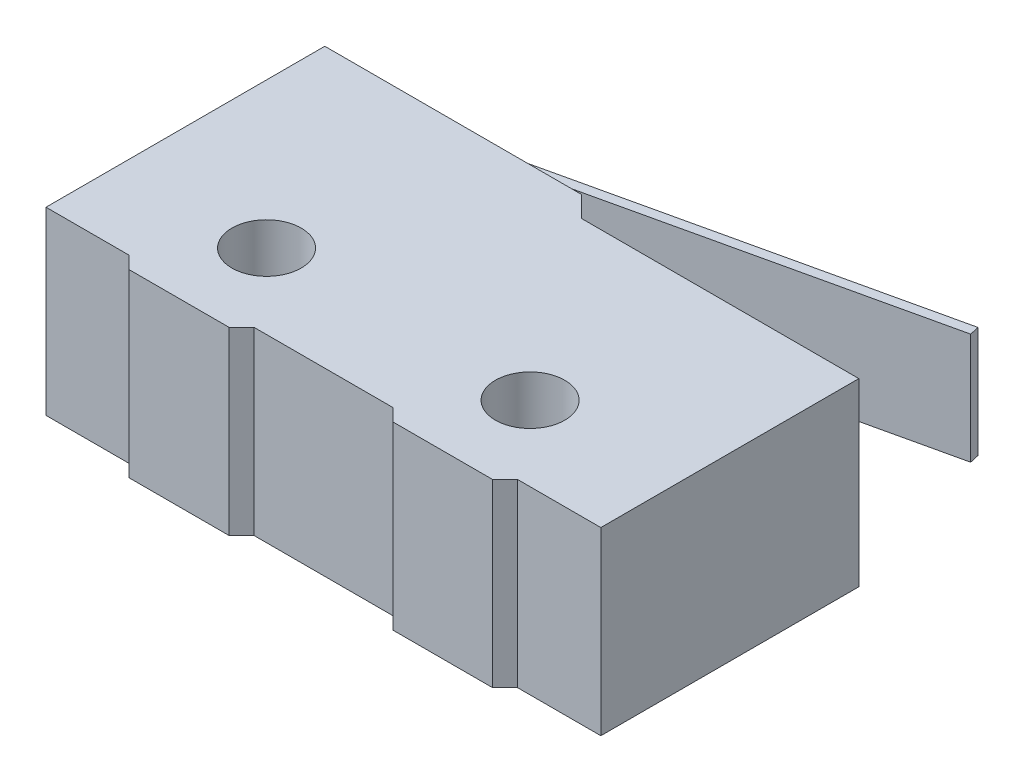
ISO-10303-21;
HEADER;
FILE_DESCRIPTION(('STEP AP214'),'2;1');
FILE_NAME('part.step','',(''),(''),'','','');
FILE_SCHEMA(('AUTOMOTIVE_DESIGN { 1 0 10303 214 1 1 1 1 }'));
ENDSEC;
DATA;
#1=APPLICATION_CONTEXT('core data for automotive mechanical design processes');
#2=APPLICATION_PROTOCOL_DEFINITION('international standard','automotive_design',2000,#1);
#3=PRODUCT_CONTEXT('',#1,'mechanical');
#4=PRODUCT('Part','Part','',(#3));
#5=PRODUCT_RELATED_PRODUCT_CATEGORY('part','',(#4));
#6=PRODUCT_DEFINITION_FORMATION('','',#4);
#7=PRODUCT_DEFINITION_CONTEXT('part definition',#1,'design');
#8=PRODUCT_DEFINITION('design','',#6,#7);
#9=PRODUCT_DEFINITION_SHAPE('','',#8);
#10=(LENGTH_UNIT() NAMED_UNIT(*) SI_UNIT(.MILLI.,.METRE.));
#11=(NAMED_UNIT(*) PLANE_ANGLE_UNIT() SI_UNIT($,.RADIAN.));
#12=(NAMED_UNIT(*) SI_UNIT($,.STERADIAN.) SOLID_ANGLE_UNIT());
#13=UNCERTAINTY_MEASURE_WITH_UNIT(LENGTH_MEASURE(1.E-05),#10,'distance_accuracy_value','');
#14=(GEOMETRIC_REPRESENTATION_CONTEXT(3) GLOBAL_UNCERTAINTY_ASSIGNED_CONTEXT((#13)) GLOBAL_UNIT_ASSIGNED_CONTEXT((#10,
#11,#12)) REPRESENTATION_CONTEXT('',''));
#15=CARTESIAN_POINT('',(0.,0.,0.));
#16=DIRECTION('',(0.,0.,1.));
#17=DIRECTION('',(1.,0.,0.));
#18=AXIS2_PLACEMENT_3D('',#15,#16,#17);
#19=CARTESIAN_POINT('',(-10.,6.5,5.25));
#20=DIRECTION('',(0.,0.,-1.));
#21=DIRECTION('',(-1.,0.,0.));
#22=AXIS2_PLACEMENT_3D('',#19,#20,#21);
#23=PLANE('',#22);
#24=DIRECTION('',(1.,0.,0.));
#25=VECTOR('',#24,1.);
#26=CARTESIAN_POINT('',(-10.,0.,5.25));
#27=LINE('',#26,#25);
#28=CARTESIAN_POINT('',(-6.55,0.,5.25));
#29=VERTEX_POINT('',#28);
#30=CARTESIAN_POINT('',(-2.95,0.,5.25));
#31=VERTEX_POINT('',#30);
#32=EDGE_CURVE('E292',#29,#31,#27,.T.);
#33=ORIENTED_EDGE('',*,*,#32,.T.);
#34=DIRECTION('',(0.,1.,0.));
#35=VECTOR('',#34,1.);
#36=CARTESIAN_POINT('',(-2.95,6.5,5.25));
#37=LINE('',#36,#35);
#38=CARTESIAN_POINT('',(-2.95,6.5,5.25));
#39=VERTEX_POINT('',#38);
#40=EDGE_CURVE('E329',#31,#39,#37,.T.);
#41=ORIENTED_EDGE('',*,*,#40,.T.);
#42=DIRECTION('',(1.,0.,0.));
#43=VECTOR('',#42,1.);
#44=CARTESIAN_POINT('',(-10.,6.5,5.25));
#45=LINE('',#44,#43);
#46=CARTESIAN_POINT('',(-6.55,6.5,5.25));
#47=VERTEX_POINT('',#46);
#48=EDGE_CURVE('E280',#47,#39,#45,.T.);
#49=ORIENTED_EDGE('',*,*,#48,.F.);
#50=DIRECTION('',(0.,-1.,0.));
#51=VECTOR('',#50,1.);
#52=CARTESIAN_POINT('',(-6.55,6.5,5.25));
#53=LINE('',#52,#51);
#54=EDGE_CURVE('E326',#47,#29,#53,.T.);
#55=ORIENTED_EDGE('',*,*,#54,.T.);
#56=EDGE_LOOP('',(#33,#41,#49,#55));
#57=FACE_BOUND('',#56,.T.);
#58=ADVANCED_FACE('F33',(#57),#23,.F.);
#59=CARTESIAN_POINT('',(-10.,6.5,-5.25));
#60=DIRECTION('',(1.,0.,0.));
#61=DIRECTION('',(0.,0.,-1.));
#62=AXIS2_PLACEMENT_3D('',#59,#60,#61);
#63=PLANE('',#62);
#64=DIRECTION('',(0.,0.,1.));
#65=VECTOR('',#64,1.);
#66=CARTESIAN_POINT('',(-10.,0.,-5.25));
#67=LINE('',#66,#65);
#68=CARTESIAN_POINT('',(-10.,0.,-5.25));
#69=VERTEX_POINT('',#68);
#70=CARTESIAN_POINT('',(-10.,0.,4.8));
#71=VERTEX_POINT('',#70);
#72=EDGE_CURVE('E272',#69,#71,#67,.T.);
#73=ORIENTED_EDGE('',*,*,#72,.T.);
#74=DIRECTION('',(0.,1.,0.));
#75=VECTOR('',#74,1.);
#76=CARTESIAN_POINT('',(-10.,6.5,4.8));
#77=LINE('',#76,#75);
#78=CARTESIAN_POINT('',(-10.,6.5,4.8));
#79=VERTEX_POINT('',#78);
#80=EDGE_CURVE('E259',#71,#79,#77,.T.);
#81=ORIENTED_EDGE('',*,*,#80,.T.);
#82=DIRECTION('',(0.,0.,1.));
#83=VECTOR('',#82,1.);
#84=CARTESIAN_POINT('',(-10.,6.5,-5.25));
#85=LINE('',#84,#83);
#86=CARTESIAN_POINT('',(-10.,6.5,-5.25));
#87=VERTEX_POINT('',#86);
#88=EDGE_CURVE('E275',#87,#79,#85,.T.);
#89=ORIENTED_EDGE('',*,*,#88,.F.);
#90=DIRECTION('',(0.,-1.,0.));
#91=VECTOR('',#90,1.);
#92=CARTESIAN_POINT('',(-10.,6.5,-5.25));
#93=LINE('',#92,#91);
#94=EDGE_CURVE('E288',#87,#69,#93,.T.);
#95=ORIENTED_EDGE('',*,*,#94,.T.);
#96=EDGE_LOOP('',(#73,#81,#89,#95));
#97=FACE_BOUND('',#96,.T.);
#98=ADVANCED_FACE('F356',(#97),#63,.F.);
#99=CARTESIAN_POINT('',(2.94999999999886,0.,5.25));
#100=VERTEX_POINT('',#99);
#101=CARTESIAN_POINT('',(6.55,0.,5.25));
#102=VERTEX_POINT('',#101);
#103=EDGE_CURVE('E291',#100,#102,#27,.T.);
#104=ORIENTED_EDGE('',*,*,#103,.T.);
#105=DIRECTION('',(0.,1.,0.));
#106=VECTOR('',#105,1.);
#107=CARTESIAN_POINT('',(6.55,6.5,5.25));
#108=LINE('',#107,#106);
#109=CARTESIAN_POINT('',(6.55,6.5,5.25));
#110=VERTEX_POINT('',#109);
#111=EDGE_CURVE('E307',#102,#110,#108,.T.);
#112=ORIENTED_EDGE('',*,*,#111,.T.);
#113=CARTESIAN_POINT('',(2.94999999999886,6.5,5.25));
#114=VERTEX_POINT('',#113);
#115=EDGE_CURVE('E278',#114,#110,#45,.T.);
#116=ORIENTED_EDGE('',*,*,#115,.F.);
#117=DIRECTION('',(0.,-1.,0.));
#118=VECTOR('',#117,1.);
#119=CARTESIAN_POINT('',(2.94999999999886,6.5,5.25));
#120=LINE('',#119,#118);
#121=EDGE_CURVE('E304',#114,#100,#120,.T.);
#122=ORIENTED_EDGE('',*,*,#121,.T.);
#123=EDGE_LOOP('',(#104,#112,#116,#122));
#124=FACE_BOUND('',#123,.T.);
#125=ADVANCED_FACE('F385',(#124),#23,.F.);
#126=CARTESIAN_POINT('',(10.,6.5,-5.25));
#127=DIRECTION('',(-1.,0.,0.));
#128=DIRECTION('',(0.,0.,1.));
#129=AXIS2_PLACEMENT_3D('',#126,#127,#128);
#130=PLANE('',#129);
#131=DIRECTION('',(0.,0.,-1.));
#132=VECTOR('',#131,1.);
#133=CARTESIAN_POINT('',(10.,0.,-5.25));
#134=LINE('',#133,#132);
#135=CARTESIAN_POINT('',(10.,0.,4.8));
#136=VERTEX_POINT('',#135);
#137=CARTESIAN_POINT('',(10.,0.,-4.5));
#138=VERTEX_POINT('',#137);
#139=EDGE_CURVE('E295',#136,#138,#134,.T.);
#140=ORIENTED_EDGE('',*,*,#139,.T.);
#141=DIRECTION('',(0.,1.,0.));
#142=VECTOR('',#141,1.);
#143=CARTESIAN_POINT('',(10.,6.5,-4.5));
#144=LINE('',#143,#142);
#145=CARTESIAN_POINT('',(10.,6.5,-4.5));
#146=VERTEX_POINT('',#145);
#147=EDGE_CURVE('E229',#138,#146,#144,.T.);
#148=ORIENTED_EDGE('',*,*,#147,.T.);
#149=DIRECTION('',(0.,0.,-1.));
#150=VECTOR('',#149,1.);
#151=CARTESIAN_POINT('',(10.,6.5,-5.25));
#152=LINE('',#151,#150);
#153=CARTESIAN_POINT('',(10.,6.5,4.8));
#154=VERTEX_POINT('',#153);
#155=EDGE_CURVE('E283',#154,#146,#152,.T.);
#156=ORIENTED_EDGE('',*,*,#155,.F.);
#157=DIRECTION('',(0.,-1.,0.));
#158=VECTOR('',#157,1.);
#159=CARTESIAN_POINT('',(10.,6.5,4.8));
#160=LINE('',#159,#158);
#161=EDGE_CURVE('E238',#154,#136,#160,.T.);
#162=ORIENTED_EDGE('',*,*,#161,.T.);
#163=EDGE_LOOP('',(#140,#148,#156,#162));
#164=FACE_BOUND('',#163,.T.);
#165=ADVANCED_FACE('F396',(#164),#130,.F.);
#166=CARTESIAN_POINT('',(-10.,6.5,-5.25));
#167=DIRECTION('',(0.,0.,1.));
#168=DIRECTION('',(1.,0.,0.));
#169=AXIS2_PLACEMENT_3D('',#166,#167,#168);
#170=PLANE('',#169);
#171=DIRECTION('',(0.,1.,0.));
#172=VECTOR('',#171,1.);
#173=CARTESIAN_POINT('',(-7.,1.25,-5.24999999999477));
#174=LINE('',#173,#172);
#175=CARTESIAN_POINT('',(-7.,1.25,-5.25));
#176=VERTEX_POINT('',#175);
#177=CARTESIAN_POINT('',(-7.,5.25,-5.25));
#178=VERTEX_POINT('',#177);
#179=EDGE_CURVE('E53',#176,#178,#174,.T.);
#180=ORIENTED_EDGE('',*,*,#179,.F.);
#181=DIRECTION('',(1.,0.,-1.49409254809488E-11));
#182=VECTOR('',#181,1.);
#183=CARTESIAN_POINT('',(-6.65,1.25,-5.25));
#184=LINE('',#183,#182);
#185=CARTESIAN_POINT('',(-6.65,1.25,-5.25));
#186=VERTEX_POINT('',#185);
#187=EDGE_CURVE('E48',#176,#186,#184,.T.);
#188=ORIENTED_EDGE('',*,*,#187,.T.);
#189=DIRECTION('',(0.,1.,0.));
#190=VECTOR('',#189,1.);
#191=CARTESIAN_POINT('',(-6.65,1.25,-5.25));
#192=LINE('',#191,#190);
#193=CARTESIAN_POINT('',(-6.65,5.25,-5.25));
#194=VERTEX_POINT('',#193);
#195=EDGE_CURVE('E190',#186,#194,#192,.T.);
#196=ORIENTED_EDGE('',*,*,#195,.T.);
#197=DIRECTION('',(1.,0.,-1.49409254809488E-11));
#198=VECTOR('',#197,1.);
#199=CARTESIAN_POINT('',(-6.65,5.25,-5.25));
#200=LINE('',#199,#198);
#201=EDGE_CURVE('E191',#178,#194,#200,.T.);
#202=ORIENTED_EDGE('',*,*,#201,.F.);
#203=EDGE_LOOP('',(#180,#188,#196,#202));
#204=FACE_BOUND('',#203,.T.);
#205=DIRECTION('',(-1.,0.,0.));
#206=VECTOR('',#205,1.);
#207=CARTESIAN_POINT('',(-10.,6.5,-5.25));
#208=LINE('',#207,#206);
#209=CARTESIAN_POINT('',(-0.750000000000002,6.5,-5.25));
#210=VERTEX_POINT('',#209);
#211=EDGE_CURVE('E286',#210,#87,#208,.T.);
#212=ORIENTED_EDGE('',*,*,#211,.F.);
#213=DIRECTION('',(0.,-1.,0.));
#214=VECTOR('',#213,1.);
#215=CARTESIAN_POINT('',(-0.750000000000001,6.5,-5.25));
#216=LINE('',#215,#214);
#217=CARTESIAN_POINT('',(-0.750000000000001,0.,-5.25));
#218=VERTEX_POINT('',#217);
#219=EDGE_CURVE('E332',#210,#218,#216,.T.);
#220=ORIENTED_EDGE('',*,*,#219,.T.);
#221=DIRECTION('',(-1.,0.,0.));
#222=VECTOR('',#221,1.);
#223=CARTESIAN_POINT('',(-10.,0.,-5.25));
#224=LINE('',#223,#222);
#225=EDGE_CURVE('E279',#218,#69,#224,.T.);
#226=ORIENTED_EDGE('',*,*,#225,.T.);
#227=ORIENTED_EDGE('',*,*,#94,.F.);
#228=EDGE_LOOP('',(#212,#220,#226,#227));
#229=FACE_BOUND('',#228,.T.);
#230=ADVANCED_FACE('F353',(#204,#229),#170,.F.);
#231=CARTESIAN_POINT('',(0.,6.5,0.));
#232=DIRECTION('',(0.,1.,0.));
#233=DIRECTION('',(0.,0.,1.));
#234=AXIS2_PLACEMENT_3D('',#231,#232,#233);
#235=PLANE('',#234);
#236=DIRECTION('',(1.,0.,0.));
#237=VECTOR('',#236,1.);
#238=CARTESIAN_POINT('',(0.,6.5,-4.5));
#239=LINE('',#238,#237);
#240=CARTESIAN_POINT('',(0.,6.5,-4.5));
#241=VERTEX_POINT('',#240);
#242=EDGE_CURVE('E216',#241,#146,#239,.T.);
#243=ORIENTED_EDGE('',*,*,#242,.F.);
#244=DIRECTION('',(0.707106781186546,0.,0.707106781186549));
#245=VECTOR('',#244,1.);
#246=CARTESIAN_POINT('',(2.25,6.5,-2.24999999999998));
#247=LINE('',#246,#245);
#248=EDGE_CURVE('E11',#241,#210,#247,.F.);
#249=ORIENTED_EDGE('',*,*,#248,.T.);
#250=ORIENTED_EDGE('',*,*,#211,.T.);
#251=ORIENTED_EDGE('',*,*,#88,.T.);
#252=DIRECTION('',(-1.,0.,0.));
#253=VECTOR('',#252,1.);
#254=CARTESIAN_POINT('',(-11.4462653199894,6.5,4.8));
#255=LINE('',#254,#253);
#256=CARTESIAN_POINT('',(-7.,6.5,4.8));
#257=VERTEX_POINT('',#256);
#258=EDGE_CURVE('E251',#257,#79,#255,.T.);
#259=ORIENTED_EDGE('',*,*,#258,.F.);
#260=DIRECTION('',(-0.707106781186548,0.,-0.707106781186548));
#261=VECTOR('',#260,1.);
#262=CARTESIAN_POINT('',(-5.9,6.5,5.9));
#263=LINE('',#262,#261);
#264=EDGE_CURVE('E310',#257,#47,#263,.F.);
#265=ORIENTED_EDGE('',*,*,#264,.T.);
#266=ORIENTED_EDGE('',*,*,#48,.T.);
#267=DIRECTION('',(-0.707106781186548,0.,0.707106781186547));
#268=VECTOR('',#267,1.);
#269=CARTESIAN_POINT('',(1.15,6.5,1.15));
#270=LINE('',#269,#268);
#271=CARTESIAN_POINT('',(-2.5,6.5,4.79999999999441));
#272=VERTEX_POINT('',#271);
#273=EDGE_CURVE('E312',#39,#272,#270,.F.);
#274=ORIENTED_EDGE('',*,*,#273,.T.);
#275=DIRECTION('',(-1.,0.,0.));
#276=VECTOR('',#275,1.);
#277=CARTESIAN_POINT('',(-2.5,6.5,4.79999999999441));
#278=LINE('',#277,#276);
#279=CARTESIAN_POINT('',(2.49999999999886,6.5,4.79999999999441));
#280=VERTEX_POINT('',#279);
#281=EDGE_CURVE('E241',#280,#272,#278,.T.);
#282=ORIENTED_EDGE('',*,*,#281,.F.);
#283=DIRECTION('',(-0.707106781186548,0.,-0.707106781186548));
#284=VECTOR('',#283,1.);
#285=CARTESIAN_POINT('',(-1.15000000000057,6.5,1.15000000000057));
#286=LINE('',#285,#284);
#287=EDGE_CURVE('E314',#280,#114,#286,.F.);
#288=ORIENTED_EDGE('',*,*,#287,.T.);
#289=ORIENTED_EDGE('',*,*,#115,.T.);
#290=DIRECTION('',(-0.707106781186551,0.,0.707106781186544));
#291=VECTOR('',#290,1.);
#292=CARTESIAN_POINT('',(5.89999999999997,6.5,5.90000000000002));
#293=LINE('',#292,#291);
#294=CARTESIAN_POINT('',(7.,6.5,4.8));
#295=VERTEX_POINT('',#294);
#296=EDGE_CURVE('E316',#110,#295,#293,.F.);
#297=ORIENTED_EDGE('',*,*,#296,.T.);
#298=DIRECTION('',(-1.,0.,0.));
#299=VECTOR('',#298,1.);
#300=CARTESIAN_POINT('',(7.,6.5,4.8));
#301=LINE('',#300,#299);
#302=EDGE_CURVE('E232',#154,#295,#301,.T.);
#303=ORIENTED_EDGE('',*,*,#302,.F.);
#304=ORIENTED_EDGE('',*,*,#155,.T.);
#305=EDGE_LOOP('',(#243,#249,#250,#251,#259,#265,#266,#274,#282,#288,#289,#297,#303,#304));
#306=FACE_BOUND('',#305,.T.);
#307=CARTESIAN_POINT('',(4.75,6.5,2.1));
#308=DIRECTION('',(0.,1.,0.));
#309=DIRECTION('',(0.,0.,1.));
#310=AXIS2_PLACEMENT_3D('',#307,#308,#309);
#311=CIRCLE('',#310,1.25);
#312=CARTESIAN_POINT('',(4.75,6.5,3.35));
#313=VERTEX_POINT('',#312);
#314=EDGE_CURVE('E262',#313,#313,#311,.T.);
#315=ORIENTED_EDGE('',*,*,#314,.F.);
#316=EDGE_LOOP('',(#315));
#317=FACE_BOUND('',#316,.T.);
#318=CARTESIAN_POINT('',(-4.75,6.5,2.1));
#319=DIRECTION('',(0.,1.,0.));
#320=DIRECTION('',(0.,0.,1.));
#321=AXIS2_PLACEMENT_3D('',#318,#319,#320);
#322=CIRCLE('',#321,1.25);
#323=CARTESIAN_POINT('',(-4.75,6.5,3.35));
#324=VERTEX_POINT('',#323);
#325=EDGE_CURVE('E266',#324,#324,#322,.T.);
#326=ORIENTED_EDGE('',*,*,#325,.F.);
#327=EDGE_LOOP('',(#326));
#328=FACE_BOUND('',#327,.T.);
#329=ADVANCED_FACE('F349',(#306,#317,#328),#235,.T.);
#330=CARTESIAN_POINT('',(0.,0.,0.));
#331=DIRECTION('',(0.,1.,0.));
#332=DIRECTION('',(0.,0.,1.));
#333=AXIS2_PLACEMENT_3D('',#330,#331,#332);
#334=PLANE('',#333);
#335=CARTESIAN_POINT('',(4.75,0.,2.1));
#336=DIRECTION('',(0.,1.,0.));
#337=DIRECTION('',(0.,0.,1.));
#338=AXIS2_PLACEMENT_3D('',#335,#336,#337);
#339=CIRCLE('',#338,1.25);
#340=CARTESIAN_POINT('',(4.75,0.,3.35));
#341=VERTEX_POINT('',#340);
#342=EDGE_CURVE('E263',#341,#341,#339,.T.);
#343=ORIENTED_EDGE('',*,*,#342,.T.);
#344=EDGE_LOOP('',(#343));
#345=FACE_BOUND('',#344,.T.);
#346=CARTESIAN_POINT('',(-4.75,0.,2.1));
#347=DIRECTION('',(0.,1.,0.));
#348=DIRECTION('',(0.,0.,1.));
#349=AXIS2_PLACEMENT_3D('',#346,#347,#348);
#350=CIRCLE('',#349,1.25);
#351=CARTESIAN_POINT('',(-4.75,0.,3.35));
#352=VERTEX_POINT('',#351);
#353=EDGE_CURVE('E269',#352,#352,#350,.T.);
#354=ORIENTED_EDGE('',*,*,#353,.T.);
#355=EDGE_LOOP('',(#354));
#356=FACE_BOUND('',#355,.T.);
#357=ORIENTED_EDGE('',*,*,#225,.F.);
#358=DIRECTION('',(-0.707106781186546,0.,-0.707106781186549));
#359=VECTOR('',#358,1.);
#360=CARTESIAN_POINT('',(-0.750000000000001,0.,-5.25));
#361=LINE('',#360,#359);
#362=CARTESIAN_POINT('',(0.,0.,-4.5));
#363=VERTEX_POINT('',#362);
#364=EDGE_CURVE('E41',#218,#363,#361,.F.);
#365=ORIENTED_EDGE('',*,*,#364,.T.);
#366=DIRECTION('',(1.,0.,0.));
#367=VECTOR('',#366,1.);
#368=CARTESIAN_POINT('',(0.,0.,-4.5));
#369=LINE('',#368,#367);
#370=EDGE_CURVE('E223',#363,#138,#369,.T.);
#371=ORIENTED_EDGE('',*,*,#370,.T.);
#372=ORIENTED_EDGE('',*,*,#139,.F.);
#373=DIRECTION('',(-1.,0.,0.));
#374=VECTOR('',#373,1.);
#375=CARTESIAN_POINT('',(0.,0.,4.8));
#376=LINE('',#375,#374);
#377=CARTESIAN_POINT('',(7.,0.,4.8));
#378=VERTEX_POINT('',#377);
#379=EDGE_CURVE('E301',#136,#378,#376,.T.);
#380=ORIENTED_EDGE('',*,*,#379,.T.);
#381=DIRECTION('',(0.707106781186551,0.,-0.707106781186544));
#382=VECTOR('',#381,1.);
#383=CARTESIAN_POINT('',(6.55,0.,5.25));
#384=LINE('',#383,#382);
#385=EDGE_CURVE('E324',#378,#102,#384,.F.);
#386=ORIENTED_EDGE('',*,*,#385,.T.);
#387=ORIENTED_EDGE('',*,*,#103,.F.);
#388=DIRECTION('',(0.707106781186548,0.,0.707106781186548));
#389=VECTOR('',#388,1.);
#390=CARTESIAN_POINT('',(2.94999999999886,0.,5.25));
#391=LINE('',#390,#389);
#392=CARTESIAN_POINT('',(2.49999999999886,0.,4.79999999999441));
#393=VERTEX_POINT('',#392);
#394=EDGE_CURVE('E322',#100,#393,#391,.F.);
#395=ORIENTED_EDGE('',*,*,#394,.T.);
#396=DIRECTION('',(-1.,0.,0.));
#397=VECTOR('',#396,1.);
#398=CARTESIAN_POINT('',(-2.5,0.,4.79999999999441));
#399=LINE('',#398,#397);
#400=CARTESIAN_POINT('',(-2.5,0.,4.79999999999441));
#401=VERTEX_POINT('',#400);
#402=EDGE_CURVE('E242',#393,#401,#399,.T.);
#403=ORIENTED_EDGE('',*,*,#402,.T.);
#404=DIRECTION('',(0.707106781186548,0.,-0.707106781186547));
#405=VECTOR('',#404,1.);
#406=CARTESIAN_POINT('',(-2.95,0.,5.25));
#407=LINE('',#406,#405);
#408=EDGE_CURVE('E320',#401,#31,#407,.F.);
#409=ORIENTED_EDGE('',*,*,#408,.T.);
#410=ORIENTED_EDGE('',*,*,#32,.F.);
#411=DIRECTION('',(0.707106781186548,0.,0.707106781186548));
#412=VECTOR('',#411,1.);
#413=CARTESIAN_POINT('',(-6.55,0.,5.25));
#414=LINE('',#413,#412);
#415=CARTESIAN_POINT('',(-7.,0.,4.8));
#416=VERTEX_POINT('',#415);
#417=EDGE_CURVE('E318',#29,#416,#414,.F.);
#418=ORIENTED_EDGE('',*,*,#417,.T.);
#419=DIRECTION('',(-1.,0.,0.));
#420=VECTOR('',#419,1.);
#421=CARTESIAN_POINT('',(-11.4462653199894,0.,4.8));
#422=LINE('',#421,#420);
#423=EDGE_CURVE('E253',#416,#71,#422,.T.);
#424=ORIENTED_EDGE('',*,*,#423,.T.);
#425=ORIENTED_EDGE('',*,*,#72,.F.);
#426=EDGE_LOOP('',(#357,#365,#371,#372,#380,#386,#387,#395,#403,#409,#410,#418,#424,#425));
#427=FACE_BOUND('',#426,.T.);
#428=ADVANCED_FACE('F337',(#345,#356,#427),#334,.F.);
#429=CARTESIAN_POINT('',(-4.75,0.,2.1));
#430=DIRECTION('',(0.,1.,0.));
#431=DIRECTION('',(0.,0.,1.));
#432=AXIS2_PLACEMENT_3D('',#429,#430,#431);
#433=CYLINDRICAL_SURFACE('',#432,1.25);
#434=CARTESIAN_POINT('',(-4.75,0.,3.35));
#435=CARTESIAN_POINT('',(-4.75,0.0677083333333332,3.35));
#436=CARTESIAN_POINT('',(-4.75,0.135416666666667,3.35));
#437=CARTESIAN_POINT('',(-4.75,0.270833333333333,3.35));
#438=CARTESIAN_POINT('',(-4.75,0.338541666666667,3.35));
#439=CARTESIAN_POINT('',(-4.75,0.473958333333333,3.35));
#440=CARTESIAN_POINT('',(-4.75,0.541666666666667,3.35));
#441=CARTESIAN_POINT('',(-4.75,0.677083333333333,3.35));
#442=CARTESIAN_POINT('',(-4.75,0.744791666666667,3.35));
#443=CARTESIAN_POINT('',(-4.75,0.880208333333333,3.35));
#444=CARTESIAN_POINT('',(-4.75,0.947916666666667,3.35));
#445=CARTESIAN_POINT('',(-4.75,1.08333333333333,3.35));
#446=CARTESIAN_POINT('',(-4.75,1.15104166666667,3.35));
#447=CARTESIAN_POINT('',(-4.75,1.28645833333333,3.35));
#448=CARTESIAN_POINT('',(-4.75,1.35416666666667,3.35));
#449=CARTESIAN_POINT('',(-4.75,1.48958333333333,3.35));
#450=CARTESIAN_POINT('',(-4.75,1.55729166666667,3.35));
#451=CARTESIAN_POINT('',(-4.75,1.69270833333333,3.35));
#452=CARTESIAN_POINT('',(-4.75,1.76041666666667,3.35));
#453=CARTESIAN_POINT('',(-4.75,1.89583333333333,3.35));
#454=CARTESIAN_POINT('',(-4.75,1.96354166666667,3.35));
#455=CARTESIAN_POINT('',(-4.75,2.09895833333333,3.35));
#456=CARTESIAN_POINT('',(-4.75,2.16666666666667,3.35));
#457=CARTESIAN_POINT('',(-4.75,2.30208333333333,3.35));
#458=CARTESIAN_POINT('',(-4.75,2.36979166666667,3.35));
#459=CARTESIAN_POINT('',(-4.75,2.50520833333333,3.35));
#460=CARTESIAN_POINT('',(-4.75,2.57291666666667,3.35));
#461=CARTESIAN_POINT('',(-4.75,2.70833333333333,3.35));
#462=CARTESIAN_POINT('',(-4.75,2.77604166666667,3.35));
#463=CARTESIAN_POINT('',(-4.75,2.91145833333333,3.35));
#464=CARTESIAN_POINT('',(-4.75,2.97916666666667,3.35));
#465=CARTESIAN_POINT('',(-4.75,3.11458333333333,3.35));
#466=CARTESIAN_POINT('',(-4.75,3.18229166666667,3.35));
#467=CARTESIAN_POINT('',(-4.75,3.31770833333333,3.35));
#468=CARTESIAN_POINT('',(-4.75,3.38541666666667,3.35));
#469=CARTESIAN_POINT('',(-4.75,3.52083333333333,3.35));
#470=CARTESIAN_POINT('',(-4.75,3.58854166666667,3.35));
#471=CARTESIAN_POINT('',(-4.75,3.72395833333333,3.35));
#472=CARTESIAN_POINT('',(-4.75,3.79166666666667,3.35));
#473=CARTESIAN_POINT('',(-4.75,3.92708333333333,3.35));
#474=CARTESIAN_POINT('',(-4.75,3.99479166666667,3.35));
#475=CARTESIAN_POINT('',(-4.75,4.13020833333333,3.35));
#476=CARTESIAN_POINT('',(-4.75,4.19791666666667,3.35));
#477=CARTESIAN_POINT('',(-4.75,4.33333333333333,3.35));
#478=CARTESIAN_POINT('',(-4.75,4.40104166666667,3.35));
#479=CARTESIAN_POINT('',(-4.75,4.53645833333333,3.35));
#480=CARTESIAN_POINT('',(-4.75,4.60416666666667,3.35));
#481=CARTESIAN_POINT('',(-4.75,4.73958333333333,3.35));
#482=CARTESIAN_POINT('',(-4.75,4.80729166666667,3.35));
#483=CARTESIAN_POINT('',(-4.75,4.94270833333333,3.35));
#484=CARTESIAN_POINT('',(-4.75,5.01041666666667,3.35));
#485=CARTESIAN_POINT('',(-4.75,5.14583333333333,3.35));
#486=CARTESIAN_POINT('',(-4.75,5.21354166666667,3.35));
#487=CARTESIAN_POINT('',(-4.75,5.34895833333333,3.35));
#488=CARTESIAN_POINT('',(-4.75,5.41666666666667,3.35));
#489=CARTESIAN_POINT('',(-4.75,5.55208333333333,3.35));
#490=CARTESIAN_POINT('',(-4.75,5.61979166666667,3.35));
#491=CARTESIAN_POINT('',(-4.75,5.75520833333333,3.35));
#492=CARTESIAN_POINT('',(-4.75,5.82291666666667,3.35));
#493=CARTESIAN_POINT('',(-4.75,5.95833333333333,3.35));
#494=CARTESIAN_POINT('',(-4.75,6.02604166666667,3.35));
#495=CARTESIAN_POINT('',(-4.75,6.16145833333333,3.35));
#496=CARTESIAN_POINT('',(-4.75,6.22916666666667,3.35));
#497=CARTESIAN_POINT('',(-4.75,6.36458333333333,3.35));
#498=CARTESIAN_POINT('',(-4.75,6.43229166666667,3.35));
#499=CARTESIAN_POINT('',(-4.75,6.5,3.35));
#500=B_SPLINE_CURVE_WITH_KNOTS('',3,(#434,#435,#436,#437,#438,#439,#440,#441,#442,#443,#444,
#445,#446,#447,#448,#449,#450,#451,#452,#453,#454,#455,#456,#457,#458,#459,#460,#461,#462,#463,
#464,#465,#466,#467,#468,#469,#470,#471,#472,#473,#474,#475,#476,#477,#478,#479,#480,#481,#482,
#483,#484,#485,#486,#487,#488,#489,#490,#491,#492,#493,#494,#495,#496,#497,#498,#499),
.UNSPECIFIED.,.F.,.F.,(4,2,2,2,2,2,2,2,2,2,2,2,2,2,2,2,2,2,2,2,2,2,2,2,2,2,2,2,2,2,2,2,4),(0.,
0.203125,0.40625,0.609375,0.8125,1.015625,1.21875,1.421875,1.625,1.828125,2.03125,2.234375,
2.4375,2.640625,2.84375,3.046875,3.25,3.453125,3.65625,3.859375,4.0625,4.265625,4.46875,
4.671875,4.875,5.078125,5.28125,5.484375,5.6875,5.890625,6.09375,6.296875,6.5),.UNSPECIFIED.);
#501=EDGE_CURVE('BSEAM437',#352,#324,#500,.T.);
#502=ORIENTED_EDGE('',*,*,#353,.F.);
#503=ORIENTED_EDGE('',*,*,#325,.T.);
#504=ORIENTED_EDGE('',*,*,#501,.T.);
#505=ORIENTED_EDGE('',*,*,#501,.F.);
#506=EDGE_LOOP('',(#502,#504,#503,#505));
#507=FACE_BOUND('',#506,.T.);
#508=ADVANCED_FACE('F437',(#507),#433,.F.);
#509=CARTESIAN_POINT('',(4.75,0.,2.1));
#510=DIRECTION('',(0.,1.,0.));
#511=DIRECTION('',(0.,0.,1.));
#512=AXIS2_PLACEMENT_3D('',#509,#510,#511);
#513=CYLINDRICAL_SURFACE('',#512,1.25);
#514=CARTESIAN_POINT('',(4.75,0.,3.35));
#515=CARTESIAN_POINT('',(4.75,0.0677083333333332,3.35));
#516=CARTESIAN_POINT('',(4.75,0.135416666666667,3.35));
#517=CARTESIAN_POINT('',(4.75,0.270833333333333,3.35));
#518=CARTESIAN_POINT('',(4.75,0.338541666666667,3.35));
#519=CARTESIAN_POINT('',(4.75,0.473958333333333,3.35));
#520=CARTESIAN_POINT('',(4.75,0.541666666666667,3.35));
#521=CARTESIAN_POINT('',(4.75,0.677083333333333,3.35));
#522=CARTESIAN_POINT('',(4.75,0.744791666666667,3.35));
#523=CARTESIAN_POINT('',(4.75,0.880208333333333,3.35));
#524=CARTESIAN_POINT('',(4.75,0.947916666666667,3.35));
#525=CARTESIAN_POINT('',(4.75,1.08333333333333,3.35));
#526=CARTESIAN_POINT('',(4.75,1.15104166666667,3.35));
#527=CARTESIAN_POINT('',(4.75,1.28645833333333,3.35));
#528=CARTESIAN_POINT('',(4.75,1.35416666666667,3.35));
#529=CARTESIAN_POINT('',(4.75,1.48958333333333,3.35));
#530=CARTESIAN_POINT('',(4.75,1.55729166666667,3.35));
#531=CARTESIAN_POINT('',(4.75,1.69270833333333,3.35));
#532=CARTESIAN_POINT('',(4.75,1.76041666666667,3.35));
#533=CARTESIAN_POINT('',(4.75,1.89583333333333,3.35));
#534=CARTESIAN_POINT('',(4.75,1.96354166666667,3.35));
#535=CARTESIAN_POINT('',(4.75,2.09895833333333,3.35));
#536=CARTESIAN_POINT('',(4.75,2.16666666666667,3.35));
#537=CARTESIAN_POINT('',(4.75,2.30208333333333,3.35));
#538=CARTESIAN_POINT('',(4.75,2.36979166666667,3.35));
#539=CARTESIAN_POINT('',(4.75,2.50520833333333,3.35));
#540=CARTESIAN_POINT('',(4.75,2.57291666666667,3.35));
#541=CARTESIAN_POINT('',(4.75,2.70833333333333,3.35));
#542=CARTESIAN_POINT('',(4.75,2.77604166666667,3.35));
#543=CARTESIAN_POINT('',(4.75,2.91145833333333,3.35));
#544=CARTESIAN_POINT('',(4.75,2.97916666666667,3.35));
#545=CARTESIAN_POINT('',(4.75,3.11458333333333,3.35));
#546=CARTESIAN_POINT('',(4.75,3.18229166666667,3.35));
#547=CARTESIAN_POINT('',(4.75,3.31770833333333,3.35));
#548=CARTESIAN_POINT('',(4.75,3.38541666666667,3.35));
#549=CARTESIAN_POINT('',(4.75,3.52083333333333,3.35));
#550=CARTESIAN_POINT('',(4.75,3.58854166666667,3.35));
#551=CARTESIAN_POINT('',(4.75,3.72395833333333,3.35));
#552=CARTESIAN_POINT('',(4.75,3.79166666666667,3.35));
#553=CARTESIAN_POINT('',(4.75,3.92708333333333,3.35));
#554=CARTESIAN_POINT('',(4.75,3.99479166666667,3.35));
#555=CARTESIAN_POINT('',(4.75,4.13020833333333,3.35));
#556=CARTESIAN_POINT('',(4.75,4.19791666666667,3.35));
#557=CARTESIAN_POINT('',(4.75,4.33333333333333,3.35));
#558=CARTESIAN_POINT('',(4.75,4.40104166666667,3.35));
#559=CARTESIAN_POINT('',(4.75,4.53645833333333,3.35));
#560=CARTESIAN_POINT('',(4.75,4.60416666666667,3.35));
#561=CARTESIAN_POINT('',(4.75,4.73958333333333,3.35));
#562=CARTESIAN_POINT('',(4.75,4.80729166666667,3.35));
#563=CARTESIAN_POINT('',(4.75,4.94270833333333,3.35));
#564=CARTESIAN_POINT('',(4.75,5.01041666666667,3.35));
#565=CARTESIAN_POINT('',(4.75,5.14583333333333,3.35));
#566=CARTESIAN_POINT('',(4.75,5.21354166666667,3.35));
#567=CARTESIAN_POINT('',(4.75,5.34895833333333,3.35));
#568=CARTESIAN_POINT('',(4.75,5.41666666666667,3.35));
#569=CARTESIAN_POINT('',(4.75,5.55208333333333,3.35));
#570=CARTESIAN_POINT('',(4.75,5.61979166666667,3.35));
#571=CARTESIAN_POINT('',(4.75,5.75520833333333,3.35));
#572=CARTESIAN_POINT('',(4.75,5.82291666666667,3.35));
#573=CARTESIAN_POINT('',(4.75,5.95833333333333,3.35));
#574=CARTESIAN_POINT('',(4.75,6.02604166666667,3.35));
#575=CARTESIAN_POINT('',(4.75,6.16145833333333,3.35));
#576=CARTESIAN_POINT('',(4.75,6.22916666666667,3.35));
#577=CARTESIAN_POINT('',(4.75,6.36458333333333,3.35));
#578=CARTESIAN_POINT('',(4.75,6.43229166666667,3.35));
#579=CARTESIAN_POINT('',(4.75,6.5,3.35));
#580=B_SPLINE_CURVE_WITH_KNOTS('',3,(#514,#515,#516,#517,#518,#519,#520,#521,#522,#523,#524,
#525,#526,#527,#528,#529,#530,#531,#532,#533,#534,#535,#536,#537,#538,#539,#540,#541,#542,#543,
#544,#545,#546,#547,#548,#549,#550,#551,#552,#553,#554,#555,#556,#557,#558,#559,#560,#561,#562,
#563,#564,#565,#566,#567,#568,#569,#570,#571,#572,#573,#574,#575,#576,#577,#578,#579),
.UNSPECIFIED.,.F.,.F.,(4,2,2,2,2,2,2,2,2,2,2,2,2,2,2,2,2,2,2,2,2,2,2,2,2,2,2,2,2,2,2,2,4),(0.,
0.203125,0.40625,0.609375,0.8125,1.015625,1.21875,1.421875,1.625,1.828125,2.03125,2.234375,
2.4375,2.640625,2.84375,3.046875,3.25,3.453125,3.65625,3.859375,4.0625,4.265625,4.46875,
4.671875,4.875,5.078125,5.28125,5.484375,5.6875,5.890625,6.09375,6.296875,6.5),.UNSPECIFIED.);
#581=EDGE_CURVE('BSEAM434',#341,#313,#580,.T.);
#582=ORIENTED_EDGE('',*,*,#342,.F.);
#583=ORIENTED_EDGE('',*,*,#314,.T.);
#584=ORIENTED_EDGE('',*,*,#581,.T.);
#585=ORIENTED_EDGE('',*,*,#581,.F.);
#586=EDGE_LOOP('',(#582,#584,#583,#585));
#587=FACE_BOUND('',#586,.T.);
#588=ADVANCED_FACE('F434',(#587),#513,.F.);
#589=CARTESIAN_POINT('',(-11.4462653199894,0.,4.8));
#590=DIRECTION('',(0.,0.,-1.));
#591=DIRECTION('',(-1.,0.,0.));
#592=AXIS2_PLACEMENT_3D('',#589,#590,#591);
#593=PLANE('',#592);
#594=ORIENTED_EDGE('',*,*,#423,.F.);
#595=DIRECTION('',(0.,1.,0.));
#596=VECTOR('',#595,1.);
#597=CARTESIAN_POINT('',(-7.,0.,4.8));
#598=LINE('',#597,#596);
#599=EDGE_CURVE('E256',#416,#257,#598,.T.);
#600=ORIENTED_EDGE('',*,*,#599,.T.);
#601=ORIENTED_EDGE('',*,*,#258,.T.);
#602=ORIENTED_EDGE('',*,*,#80,.F.);
#603=EDGE_LOOP('',(#594,#600,#601,#602));
#604=FACE_BOUND('',#603,.T.);
#605=ADVANCED_FACE('F431',(#604),#593,.F.);
#606=CARTESIAN_POINT('',(-2.5,0.,4.79999999999441));
#607=DIRECTION('',(0.,0.,-1.));
#608=DIRECTION('',(-1.,0.,0.));
#609=AXIS2_PLACEMENT_3D('',#606,#607,#608);
#610=PLANE('',#609);
#611=ORIENTED_EDGE('',*,*,#281,.T.);
#612=DIRECTION('',(0.,1.,0.));
#613=VECTOR('',#612,1.);
#614=CARTESIAN_POINT('',(-2.5,0.,4.79999999999441));
#615=LINE('',#614,#613);
#616=EDGE_CURVE('E248',#401,#272,#615,.T.);
#617=ORIENTED_EDGE('',*,*,#616,.F.);
#618=ORIENTED_EDGE('',*,*,#402,.F.);
#619=DIRECTION('',(0.,1.,0.));
#620=VECTOR('',#619,1.);
#621=CARTESIAN_POINT('',(2.49999999999886,0.,4.79999999999441));
#622=LINE('',#621,#620);
#623=EDGE_CURVE('E245',#393,#280,#622,.T.);
#624=ORIENTED_EDGE('',*,*,#623,.T.);
#625=EDGE_LOOP('',(#611,#617,#618,#624));
#626=FACE_BOUND('',#625,.T.);
#627=ADVANCED_FACE('F376',(#626),#610,.F.);
#628=CARTESIAN_POINT('',(7.,0.,4.8));
#629=DIRECTION('',(0.,0.,-1.));
#630=DIRECTION('',(-1.,0.,0.));
#631=AXIS2_PLACEMENT_3D('',#628,#629,#630);
#632=PLANE('',#631);
#633=ORIENTED_EDGE('',*,*,#302,.T.);
#634=DIRECTION('',(0.,1.,0.));
#635=VECTOR('',#634,1.);
#636=CARTESIAN_POINT('',(7.,0.,4.8));
#637=LINE('',#636,#635);
#638=EDGE_CURVE('E235',#378,#295,#637,.T.);
#639=ORIENTED_EDGE('',*,*,#638,.F.);
#640=ORIENTED_EDGE('',*,*,#379,.F.);
#641=ORIENTED_EDGE('',*,*,#161,.F.);
#642=EDGE_LOOP('',(#633,#639,#640,#641));
#643=FACE_BOUND('',#642,.T.);
#644=ADVANCED_FACE('F394',(#643),#632,.F.);
#645=CARTESIAN_POINT('',(6.55,6.5,5.25));
#646=DIRECTION('',(-0.707106781186544,0.,-0.707106781186551));
#647=DIRECTION('',(0.,1.,0.));
#648=AXIS2_PLACEMENT_3D('',#645,#646,#647);
#649=PLANE('',#648);
#650=ORIENTED_EDGE('',*,*,#385,.F.);
#651=ORIENTED_EDGE('',*,*,#638,.T.);
#652=ORIENTED_EDGE('',*,*,#296,.F.);
#653=ORIENTED_EDGE('',*,*,#111,.F.);
#654=EDGE_LOOP('',(#650,#651,#652,#653));
#655=FACE_BOUND('',#654,.T.);
#656=ADVANCED_FACE('F390',(#655),#649,.F.);
#657=CARTESIAN_POINT('',(2.94999999999886,6.5,5.25));
#658=DIRECTION('',(0.707106781186548,0.,-0.707106781186548));
#659=DIRECTION('',(0.,-1.,0.));
#660=AXIS2_PLACEMENT_3D('',#657,#658,#659);
#661=PLANE('',#660);
#662=ORIENTED_EDGE('',*,*,#287,.F.);
#663=ORIENTED_EDGE('',*,*,#623,.F.);
#664=ORIENTED_EDGE('',*,*,#394,.F.);
#665=ORIENTED_EDGE('',*,*,#121,.F.);
#666=EDGE_LOOP('',(#662,#663,#664,#665));
#667=FACE_BOUND('',#666,.T.);
#668=ADVANCED_FACE('F379',(#667),#661,.F.);
#669=CARTESIAN_POINT('',(-2.95,6.5,5.25));
#670=DIRECTION('',(-0.707106781186547,0.,-0.707106781186548));
#671=DIRECTION('',(0.,1.,0.));
#672=AXIS2_PLACEMENT_3D('',#669,#670,#671);
#673=PLANE('',#672);
#674=ORIENTED_EDGE('',*,*,#408,.F.);
#675=ORIENTED_EDGE('',*,*,#616,.T.);
#676=ORIENTED_EDGE('',*,*,#273,.F.);
#677=ORIENTED_EDGE('',*,*,#40,.F.);
#678=EDGE_LOOP('',(#674,#675,#676,#677));
#679=FACE_BOUND('',#678,.T.);
#680=ADVANCED_FACE('F372',(#679),#673,.F.);
#681=CARTESIAN_POINT('',(-6.55,6.5,5.25));
#682=DIRECTION('',(0.707106781186548,0.,-0.707106781186548));
#683=DIRECTION('',(0.,-1.,0.));
#684=AXIS2_PLACEMENT_3D('',#681,#682,#683);
#685=PLANE('',#684);
#686=ORIENTED_EDGE('',*,*,#264,.F.);
#687=ORIENTED_EDGE('',*,*,#599,.F.);
#688=ORIENTED_EDGE('',*,*,#417,.F.);
#689=ORIENTED_EDGE('',*,*,#54,.F.);
#690=EDGE_LOOP('',(#686,#687,#688,#689));
#691=FACE_BOUND('',#690,.T.);
#692=ADVANCED_FACE('F364',(#691),#685,.F.);
#693=CARTESIAN_POINT('',(0.,0.,-4.5));
#694=DIRECTION('',(0.,0.,1.));
#695=DIRECTION('',(1.,0.,0.));
#696=AXIS2_PLACEMENT_3D('',#693,#694,#695);
#697=PLANE('',#696);
#698=ORIENTED_EDGE('',*,*,#370,.F.);
#699=DIRECTION('',(0.,1.,0.));
#700=VECTOR('',#699,1.);
#701=CARTESIAN_POINT('',(0.,0.,-4.5));
#702=LINE('',#701,#700);
#703=EDGE_CURVE('E226',#363,#241,#702,.T.);
#704=ORIENTED_EDGE('',*,*,#703,.T.);
#705=ORIENTED_EDGE('',*,*,#242,.T.);
#706=ORIENTED_EDGE('',*,*,#147,.F.);
#707=EDGE_LOOP('',(#698,#704,#705,#706));
#708=FACE_BOUND('',#707,.T.);
#709=ADVANCED_FACE('F344',(#708),#697,.F.);
#710=CARTESIAN_POINT('',(-0.750000000000001,6.5,-5.25));
#711=DIRECTION('',(-0.707106781186549,0.,0.707106781186546));
#712=DIRECTION('',(0.,-1.,0.));
#713=AXIS2_PLACEMENT_3D('',#710,#711,#712);
#714=PLANE('',#713);
#715=ORIENTED_EDGE('',*,*,#248,.F.);
#716=ORIENTED_EDGE('',*,*,#703,.F.);
#717=ORIENTED_EDGE('',*,*,#364,.F.);
#718=ORIENTED_EDGE('',*,*,#219,.F.);
#719=EDGE_LOOP('',(#715,#716,#717,#718));
#720=FACE_BOUND('',#719,.T.);
#721=ADVANCED_FACE('F35',(#720),#714,.F.);
#722=CARTESIAN_POINT('',(-6.65000000003222,1.25,-5.52766820223808));
#723=DIRECTION('',(1.,0.,-1.16037364816549E-10));
#724=DIRECTION('',(-1.16037364816549E-10,0.,-1.));
#725=AXIS2_PLACEMENT_3D('',#722,#723,#724);
#726=PLANE('',#725);
#727=DIRECTION('',(-1.16037364816549E-10,0.,-1.));
#728=VECTOR('',#727,1.);
#729=CARTESIAN_POINT('',(-6.65000000003222,5.25,-5.52766820223808));
#730=LINE('',#729,#728);
#731=CARTESIAN_POINT('',(-6.65000000003222,5.25,-5.52766820223808));
#732=VERTEX_POINT('',#731);
#733=EDGE_CURVE('E204',#194,#732,#730,.T.);
#734=ORIENTED_EDGE('',*,*,#733,.F.);
#735=ORIENTED_EDGE('',*,*,#195,.F.);
#736=DIRECTION('',(-1.16037364816549E-10,0.,-1.));
#737=VECTOR('',#736,1.);
#738=CARTESIAN_POINT('',(-6.65000000003222,1.25,-5.52766820223808));
#739=LINE('',#738,#737);
#740=CARTESIAN_POINT('',(-6.65000000003222,1.25,-5.52766820223808));
#741=VERTEX_POINT('',#740);
#742=EDGE_CURVE('E184',#186,#741,#739,.T.);
#743=ORIENTED_EDGE('',*,*,#742,.T.);
#744=DIRECTION('',(0.,1.,0.));
#745=VECTOR('',#744,1.);
#746=CARTESIAN_POINT('',(-6.65000000003222,1.25,-5.52766820223808));
#747=LINE('',#746,#745);
#748=EDGE_CURVE('E168',#741,#732,#747,.T.);
#749=ORIENTED_EDGE('',*,*,#748,.T.);
#750=EDGE_LOOP('',(#734,#735,#743,#749));
#751=FACE_BOUND('',#750,.T.);
#752=ADVANCED_FACE('F189',(#751),#726,.T.);
#753=CARTESIAN_POINT('',(-7.,1.25,-5.24999999999477));
#754=DIRECTION('',(-1.,0.,0.));
#755=DIRECTION('',(0.,0.,1.));
#756=AXIS2_PLACEMENT_3D('',#753,#754,#755);
#757=PLANE('',#756);
#758=DIRECTION('',(0.,0.,1.));
#759=VECTOR('',#758,1.);
#760=CARTESIAN_POINT('',(-7.,5.25,-5.24999999999477));
#761=LINE('',#760,#759);
#762=CARTESIAN_POINT('',(-7.,5.25,-5.80731965591725));
#763=VERTEX_POINT('',#762);
#764=EDGE_CURVE('E194',#763,#178,#761,.T.);
#765=ORIENTED_EDGE('',*,*,#764,.F.);
#766=DIRECTION('',(0.,1.,0.));
#767=VECTOR('',#766,1.);
#768=CARTESIAN_POINT('',(-7.,1.25,-5.80731965591725));
#769=LINE('',#768,#767);
#770=CARTESIAN_POINT('',(-7.,1.25,-5.80731965591725));
#771=VERTEX_POINT('',#770);
#772=EDGE_CURVE('E218',#771,#763,#769,.T.);
#773=ORIENTED_EDGE('',*,*,#772,.F.);
#774=DIRECTION('',(0.,0.,1.));
#775=VECTOR('',#774,1.);
#776=CARTESIAN_POINT('',(-7.,1.25,-5.24999999999477));
#777=LINE('',#776,#775);
#778=EDGE_CURVE('E201',#771,#176,#777,.T.);
#779=ORIENTED_EDGE('',*,*,#778,.T.);
#780=ORIENTED_EDGE('',*,*,#179,.T.);
#781=EDGE_LOOP('',(#765,#773,#779,#780));
#782=FACE_BOUND('',#781,.T.);
#783=ADVANCED_FACE('F553',(#782),#757,.T.);
#784=CARTESIAN_POINT('',(-7.,1.25,-5.80731965591725));
#785=DIRECTION('',(-0.220697435021502,0.,-0.975342320508513));
#786=DIRECTION('',(-0.975342320508513,0.,0.220697435021502));
#787=AXIS2_PLACEMENT_3D('',#784,#785,#786);
#788=PLANE('',#787);
#789=DIRECTION('',(-0.975342320508513,0.,0.220697435021502));
#790=VECTOR('',#789,1.);
#791=CARTESIAN_POINT('',(-7.,5.25,-5.80731965591725));
#792=LINE('',#791,#790);
#793=CARTESIAN_POINT('',(9.3,5.25,-9.49563309747377));
#794=VERTEX_POINT('',#793);
#795=EDGE_CURVE('E210',#794,#763,#792,.T.);
#796=ORIENTED_EDGE('',*,*,#795,.F.);
#797=DIRECTION('',(0.,1.,0.));
#798=VECTOR('',#797,1.);
#799=CARTESIAN_POINT('',(9.3,1.25,-9.49563309747377));
#800=LINE('',#799,#798);
#801=CARTESIAN_POINT('',(9.3,1.25,-9.49563309747377));
#802=VERTEX_POINT('',#801);
#803=EDGE_CURVE('E220',#802,#794,#800,.T.);
#804=ORIENTED_EDGE('',*,*,#803,.F.);
#805=DIRECTION('',(-0.975342320508513,0.,0.220697435021502));
#806=VECTOR('',#805,1.);
#807=CARTESIAN_POINT('',(-7.,1.25,-5.80731965591725));
#808=LINE('',#807,#806);
#809=EDGE_CURVE('E198',#802,#771,#808,.T.);
#810=ORIENTED_EDGE('',*,*,#809,.T.);
#811=ORIENTED_EDGE('',*,*,#772,.T.);
#812=EDGE_LOOP('',(#796,#804,#810,#811));
#813=FACE_BOUND('',#812,.T.);
#814=ADVANCED_FACE('F561',(#813),#788,.T.);
#815=CARTESIAN_POINT('',(9.3,1.25,-9.49563309747377));
#816=DIRECTION('',(0.975342320508512,0.,-0.220697435021502));
#817=DIRECTION('',(-0.220697435021502,0.,-0.975342320508512));
#818=AXIS2_PLACEMENT_3D('',#815,#816,#817);
#819=PLANE('',#818);
#820=DIRECTION('',(-0.220697435021502,0.,-0.975342320508512));
#821=VECTOR('',#820,1.);
#822=CARTESIAN_POINT('',(9.3,5.25,-9.49563309747377));
#823=LINE('',#822,#821);
#824=CARTESIAN_POINT('',(9.37724410225753,5.25,-9.15426328529579));
#825=VERTEX_POINT('',#824);
#826=EDGE_CURVE('E207',#825,#794,#823,.T.);
#827=ORIENTED_EDGE('',*,*,#826,.F.);
#828=DIRECTION('',(0.,1.,0.));
#829=VECTOR('',#828,1.);
#830=CARTESIAN_POINT('',(9.37724410225753,1.25,-9.15426328529579));
#831=LINE('',#830,#829);
#832=CARTESIAN_POINT('',(9.37724410225753,1.25,-9.15426328529579));
#833=VERTEX_POINT('',#832);
#834=EDGE_CURVE('E178',#833,#825,#831,.T.);
#835=ORIENTED_EDGE('',*,*,#834,.F.);
#836=DIRECTION('',(-0.220697435021502,0.,-0.975342320508512));
#837=VECTOR('',#836,1.);
#838=CARTESIAN_POINT('',(9.3,1.25,-9.49563309747377));
#839=LINE('',#838,#837);
#840=EDGE_CURVE('E187',#833,#802,#839,.T.);
#841=ORIENTED_EDGE('',*,*,#840,.T.);
#842=ORIENTED_EDGE('',*,*,#803,.T.);
#843=EDGE_LOOP('',(#827,#835,#841,#842));
#844=FACE_BOUND('',#843,.T.);
#845=ADVANCED_FACE('F571',(#844),#819,.T.);
#846=CARTESIAN_POINT('',(9.37724410225753,1.25,-9.15426328529579));
#847=DIRECTION('',(0.220697435022418,0.,0.975342320508305));
#848=DIRECTION('',(0.975342320508305,0.,-0.220697435022418));
#849=AXIS2_PLACEMENT_3D('',#846,#847,#848);
#850=PLANE('',#849);
#851=DIRECTION('',(0.975342320508305,0.,-0.220697435022418));
#852=VECTOR('',#851,1.);
#853=CARTESIAN_POINT('',(9.37724410225753,5.25,-9.15426328529579));
#854=LINE('',#853,#852);
#855=EDGE_CURVE('E173',#732,#825,#854,.T.);
#856=ORIENTED_EDGE('',*,*,#855,.F.);
#857=ORIENTED_EDGE('',*,*,#748,.F.);
#858=DIRECTION('',(0.975342320508305,0.,-0.220697435022418));
#859=VECTOR('',#858,1.);
#860=CARTESIAN_POINT('',(9.37724410225753,1.25,-9.15426328529579));
#861=LINE('',#860,#859);
#862=EDGE_CURVE('E171',#741,#833,#861,.T.);
#863=ORIENTED_EDGE('',*,*,#862,.T.);
#864=ORIENTED_EDGE('',*,*,#834,.T.);
#865=EDGE_LOOP('',(#856,#857,#863,#864));
#866=FACE_BOUND('',#865,.T.);
#867=ADVANCED_FACE('F170',(#866),#850,.T.);
#868=CARTESIAN_POINT('',(0.,1.25,0.));
#869=DIRECTION('',(0.,-1.,0.));
#870=DIRECTION('',(0.,0.,-1.));
#871=AXIS2_PLACEMENT_3D('',#868,#869,#870);
#872=PLANE('',#871);
#873=ORIENTED_EDGE('',*,*,#742,.F.);
#874=ORIENTED_EDGE('',*,*,#187,.F.);
#875=ORIENTED_EDGE('',*,*,#778,.F.);
#876=ORIENTED_EDGE('',*,*,#809,.F.);
#877=ORIENTED_EDGE('',*,*,#840,.F.);
#878=ORIENTED_EDGE('',*,*,#862,.F.);
#879=EDGE_LOOP('',(#873,#874,#875,#876,#877,#878));
#880=FACE_BOUND('',#879,.T.);
#881=ADVANCED_FACE('F183',(#880),#872,.T.);
#882=CARTESIAN_POINT('',(0.,5.25,0.));
#883=DIRECTION('',(0.,-1.,0.));
#884=DIRECTION('',(0.,0.,-1.));
#885=AXIS2_PLACEMENT_3D('',#882,#883,#884);
#886=PLANE('',#885);
#887=ORIENTED_EDGE('',*,*,#733,.T.);
#888=ORIENTED_EDGE('',*,*,#855,.T.);
#889=ORIENTED_EDGE('',*,*,#826,.T.);
#890=ORIENTED_EDGE('',*,*,#795,.T.);
#891=ORIENTED_EDGE('',*,*,#764,.T.);
#892=ORIENTED_EDGE('',*,*,#201,.T.);
#893=EDGE_LOOP('',(#887,#888,#889,#890,#891,#892));
#894=FACE_BOUND('',#893,.T.);
#895=ADVANCED_FACE('F597',(#894),#886,.F.);
#896=CLOSED_SHELL('',(#58,#98,#125,#165,#230,#329,#428,#508,#588,#605,#627,#644,#656,#668,#680,
#692,#709,#721,#752,#783,#814,#845,#867,#881,#895));
#897=MANIFOLD_SOLID_BREP('B2',#896);
#898=ADVANCED_BREP_SHAPE_REPRESENTATION('',(#18,#897),#14);
#899=SHAPE_DEFINITION_REPRESENTATION(#9,#898);
ENDSEC;
END-ISO-10303-21;
